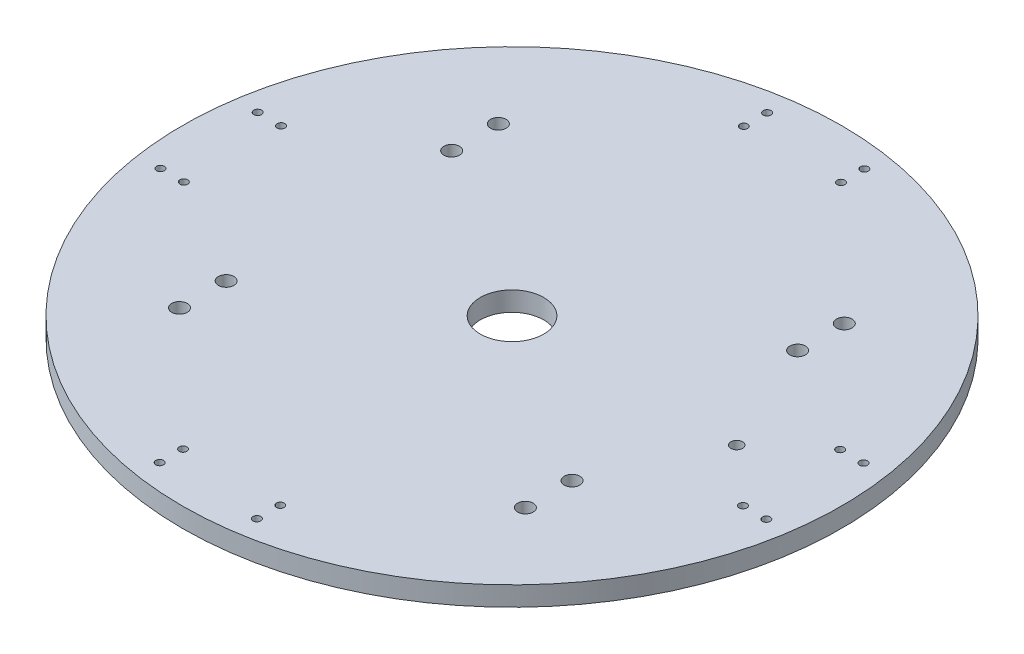
ISO-10303-21;
HEADER;
FILE_DESCRIPTION(('STEP AP214'),'2;1');
FILE_NAME('part.step','',(''),(''),'','','');
FILE_SCHEMA(('AUTOMOTIVE_DESIGN { 1 0 10303 214 1 1 1 1 }'));
ENDSEC;
DATA;
#1=APPLICATION_CONTEXT('core data for automotive mechanical design processes');
#2=APPLICATION_PROTOCOL_DEFINITION('international standard','automotive_design',2000,#1);
#3=PRODUCT_CONTEXT('',#1,'mechanical');
#4=PRODUCT('Part','Part','',(#3));
#5=PRODUCT_RELATED_PRODUCT_CATEGORY('part','',(#4));
#6=PRODUCT_DEFINITION_FORMATION('','',#4);
#7=PRODUCT_DEFINITION_CONTEXT('part definition',#1,'design');
#8=PRODUCT_DEFINITION('design','',#6,#7);
#9=PRODUCT_DEFINITION_SHAPE('','',#8);
#10=(LENGTH_UNIT() NAMED_UNIT(*) SI_UNIT(.MILLI.,.METRE.));
#11=(NAMED_UNIT(*) PLANE_ANGLE_UNIT() SI_UNIT($,.RADIAN.));
#12=(NAMED_UNIT(*) SI_UNIT($,.STERADIAN.) SOLID_ANGLE_UNIT());
#13=UNCERTAINTY_MEASURE_WITH_UNIT(LENGTH_MEASURE(1.E-05),#10,'distance_accuracy_value','');
#14=(GEOMETRIC_REPRESENTATION_CONTEXT(3) GLOBAL_UNCERTAINTY_ASSIGNED_CONTEXT((#13)) GLOBAL_UNIT_ASSIGNED_CONTEXT((#10,
#11,#12)) REPRESENTATION_CONTEXT('',''));
#15=CARTESIAN_POINT('',(0.,0.,0.));
#16=DIRECTION('',(0.,0.,1.));
#17=DIRECTION('',(1.,0.,0.));
#18=AXIS2_PLACEMENT_3D('',#15,#16,#17);
#19=CARTESIAN_POINT('',(0.,60.,0.));
#20=DIRECTION('',(0.,-1.,0.));
#21=DIRECTION('',(0.,0.,-1.));
#22=AXIS2_PLACEMENT_3D('',#19,#20,#21);
#23=PLANE('',#22);
#24=CARTESIAN_POINT('',(55.4902217167998,60.,-69.8));
#25=DIRECTION('',(0.,1.,0.));
#26=DIRECTION('',(0.,0.,1.));
#27=AXIS2_PLACEMENT_3D('',#24,#25,#26);
#28=CIRCLE('',#27,2.);
#29=CARTESIAN_POINT('',(55.4902217167998,60.,-67.8));
#30=VERTEX_POINT('',#29);
#31=EDGE_CURVE('E255',#30,#30,#28,.T.);
#32=ORIENTED_EDGE('',*,*,#31,.F.);
#33=EDGE_LOOP('',(#32));
#34=FACE_BOUND('',#33,.T.);
#35=CARTESIAN_POINT('',(55.4902217167998,60.,-57.8));
#36=DIRECTION('',(0.,1.,0.));
#37=DIRECTION('',(0.,0.,1.));
#38=AXIS2_PLACEMENT_3D('',#35,#36,#37);
#39=CIRCLE('',#38,2.);
#40=CARTESIAN_POINT('',(55.4902217167998,60.,-55.8));
#41=VERTEX_POINT('',#40);
#42=EDGE_CURVE('E247',#41,#41,#39,.T.);
#43=ORIENTED_EDGE('',*,*,#42,.F.);
#44=EDGE_LOOP('',(#43));
#45=FACE_BOUND('',#44,.T.);
#46=CARTESIAN_POINT('',(144.450852961086,60.,-57.8));
#47=DIRECTION('',(0.,1.,0.));
#48=DIRECTION('',(0.,0.,1.));
#49=AXIS2_PLACEMENT_3D('',#46,#47,#48);
#50=CIRCLE('',#49,2.);
#51=CARTESIAN_POINT('',(144.450852961086,60.,-55.8));
#52=VERTEX_POINT('',#51);
#53=EDGE_CURVE('E239',#52,#52,#50,.T.);
#54=ORIENTED_EDGE('',*,*,#53,.F.);
#55=EDGE_LOOP('',(#54));
#56=FACE_BOUND('',#55,.T.);
#57=CARTESIAN_POINT('',(144.450852961086,60.,-69.8));
#58=DIRECTION('',(0.,1.,0.));
#59=DIRECTION('',(0.,0.,1.));
#60=AXIS2_PLACEMENT_3D('',#57,#58,#59);
#61=CIRCLE('',#60,2.);
#62=CARTESIAN_POINT('',(144.450852961086,60.,-67.8));
#63=VERTEX_POINT('',#62);
#64=EDGE_CURVE('E231',#63,#63,#61,.T.);
#65=ORIENTED_EDGE('',*,*,#64,.F.);
#66=EDGE_LOOP('',(#65));
#67=FACE_BOUND('',#66,.T.);
#68=CARTESIAN_POINT('',(55.4902217167998,60.,-127.8));
#69=DIRECTION('',(0.,1.,0.));
#70=DIRECTION('',(0.,0.,1.));
#71=AXIS2_PLACEMENT_3D('',#68,#69,#70);
#72=CIRCLE('',#71,2.);
#73=CARTESIAN_POINT('',(55.4902217167998,60.,-125.8));
#74=VERTEX_POINT('',#73);
#75=EDGE_CURVE('E223',#74,#74,#72,.T.);
#76=ORIENTED_EDGE('',*,*,#75,.F.);
#77=EDGE_LOOP('',(#76));
#78=FACE_BOUND('',#77,.T.);
#79=CARTESIAN_POINT('',(55.4902217167998,60.,-139.8));
#80=DIRECTION('',(0.,1.,0.));
#81=DIRECTION('',(0.,0.,1.));
#82=AXIS2_PLACEMENT_3D('',#79,#80,#81);
#83=CIRCLE('',#82,2.);
#84=CARTESIAN_POINT('',(55.4902217167998,60.,-137.8));
#85=VERTEX_POINT('',#84);
#86=EDGE_CURVE('E215',#85,#85,#83,.T.);
#87=ORIENTED_EDGE('',*,*,#86,.F.);
#88=EDGE_LOOP('',(#87));
#89=FACE_BOUND('',#88,.T.);
#90=CARTESIAN_POINT('',(144.450852961086,60.,-139.8));
#91=DIRECTION('',(0.,1.,0.));
#92=DIRECTION('',(0.,0.,1.));
#93=AXIS2_PLACEMENT_3D('',#90,#91,#92);
#94=CIRCLE('',#93,2.);
#95=CARTESIAN_POINT('',(144.450852961086,60.,-137.8));
#96=VERTEX_POINT('',#95);
#97=EDGE_CURVE('E207',#96,#96,#94,.T.);
#98=ORIENTED_EDGE('',*,*,#97,.F.);
#99=EDGE_LOOP('',(#98));
#100=FACE_BOUND('',#99,.T.);
#101=CARTESIAN_POINT('',(144.450852961086,60.,-127.8));
#102=DIRECTION('',(0.,1.,0.));
#103=DIRECTION('',(0.,0.,1.));
#104=AXIS2_PLACEMENT_3D('',#101,#102,#103);
#105=CIRCLE('',#104,2.);
#106=CARTESIAN_POINT('',(144.450852961086,60.,-125.8));
#107=VERTEX_POINT('',#106);
#108=EDGE_CURVE('E199',#107,#107,#105,.T.);
#109=ORIENTED_EDGE('',*,*,#108,.F.);
#110=EDGE_LOOP('',(#109));
#111=FACE_BOUND('',#110,.T.);
#112=CARTESIAN_POINT('',(28.,60.,-111.4));
#113=DIRECTION('',(0.,1.,0.));
#114=DIRECTION('',(0.,0.,1.));
#115=AXIS2_PLACEMENT_3D('',#112,#113,#114);
#116=CIRCLE('',#115,0.999999999999997);
#117=CARTESIAN_POINT('',(28.,60.,-110.4));
#118=VERTEX_POINT('',#117);
#119=EDGE_CURVE('E191',#118,#118,#116,.T.);
#120=ORIENTED_EDGE('',*,*,#119,.F.);
#121=EDGE_LOOP('',(#120));
#122=FACE_BOUND('',#121,.T.);
#123=CARTESIAN_POINT('',(22.,60.,-111.4));
#124=DIRECTION('',(0.,1.,0.));
#125=DIRECTION('',(0.,0.,1.));
#126=AXIS2_PLACEMENT_3D('',#123,#124,#125);
#127=CIRCLE('',#126,0.999999999999997);
#128=CARTESIAN_POINT('',(22.,60.,-110.4));
#129=VERTEX_POINT('',#128);
#130=EDGE_CURVE('E183',#129,#129,#127,.T.);
#131=ORIENTED_EDGE('',*,*,#130,.F.);
#132=EDGE_LOOP('',(#131));
#133=FACE_BOUND('',#132,.T.);
#134=CARTESIAN_POINT('',(28.,60.,-86.4));
#135=DIRECTION('',(0.,1.,0.));
#136=DIRECTION('',(0.,0.,1.));
#137=AXIS2_PLACEMENT_3D('',#134,#135,#136);
#138=CIRCLE('',#137,0.999999999999997);
#139=CARTESIAN_POINT('',(28.,60.,-85.4));
#140=VERTEX_POINT('',#139);
#141=EDGE_CURVE('E175',#140,#140,#138,.T.);
#142=ORIENTED_EDGE('',*,*,#141,.F.);
#143=EDGE_LOOP('',(#142));
#144=FACE_BOUND('',#143,.T.);
#145=CARTESIAN_POINT('',(22.,60.,-86.4));
#146=DIRECTION('',(0.,1.,0.));
#147=DIRECTION('',(0.,0.,1.));
#148=AXIS2_PLACEMENT_3D('',#145,#146,#147);
#149=CIRCLE('',#148,0.999999999999997);
#150=CARTESIAN_POINT('',(22.,60.,-85.4));
#151=VERTEX_POINT('',#150);
#152=EDGE_CURVE('E167',#151,#151,#149,.T.);
#153=ORIENTED_EDGE('',*,*,#152,.F.);
#154=EDGE_LOOP('',(#153));
#155=FACE_BOUND('',#154,.T.);
#156=CARTESIAN_POINT('',(87.3999999999993,60.,-26.8000000000001));
#157=DIRECTION('',(0.,1.,0.));
#158=DIRECTION('',(0.,0.,1.));
#159=AXIS2_PLACEMENT_3D('',#156,#157,#158);
#160=CIRCLE('',#159,1.);
#161=CARTESIAN_POINT('',(87.3999999999993,60.,-25.8000000000001));
#162=VERTEX_POINT('',#161);
#163=EDGE_CURVE('E159',#162,#162,#160,.T.);
#164=ORIENTED_EDGE('',*,*,#163,.F.);
#165=EDGE_LOOP('',(#164));
#166=FACE_BOUND('',#165,.T.);
#167=CARTESIAN_POINT('',(87.3999999999992,60.,-20.8000000000001));
#168=DIRECTION('',(0.,1.,0.));
#169=DIRECTION('',(0.,0.,1.));
#170=AXIS2_PLACEMENT_3D('',#167,#168,#169);
#171=CIRCLE('',#170,1.);
#172=CARTESIAN_POINT('',(87.3999999999992,60.,-19.8000000000001));
#173=VERTEX_POINT('',#172);
#174=EDGE_CURVE('E151',#173,#173,#171,.T.);
#175=ORIENTED_EDGE('',*,*,#174,.F.);
#176=EDGE_LOOP('',(#175));
#177=FACE_BOUND('',#176,.T.);
#178=CARTESIAN_POINT('',(112.399999999999,60.,-20.7999999999999));
#179=DIRECTION('',(0.,1.,0.));
#180=DIRECTION('',(0.,0.,1.));
#181=AXIS2_PLACEMENT_3D('',#178,#179,#180);
#182=CIRCLE('',#181,1.);
#183=CARTESIAN_POINT('',(112.399999999999,60.,-19.7999999999999));
#184=VERTEX_POINT('',#183);
#185=EDGE_CURVE('E143',#184,#184,#182,.T.);
#186=ORIENTED_EDGE('',*,*,#185,.F.);
#187=EDGE_LOOP('',(#186));
#188=FACE_BOUND('',#187,.T.);
#189=CARTESIAN_POINT('',(112.399999999999,60.,-26.7999999999999));
#190=DIRECTION('',(0.,1.,0.));
#191=DIRECTION('',(0.,0.,1.));
#192=AXIS2_PLACEMENT_3D('',#189,#190,#191);
#193=CIRCLE('',#192,1.);
#194=CARTESIAN_POINT('',(112.399999999999,60.,-25.7999999999999));
#195=VERTEX_POINT('',#194);
#196=EDGE_CURVE('E135',#195,#195,#193,.T.);
#197=ORIENTED_EDGE('',*,*,#196,.F.);
#198=EDGE_LOOP('',(#197));
#199=FACE_BOUND('',#198,.T.);
#200=CARTESIAN_POINT('',(172.,60.,-86.1999999999995));
#201=DIRECTION('',(0.,1.,0.));
#202=DIRECTION('',(0.,0.,1.));
#203=AXIS2_PLACEMENT_3D('',#200,#201,#202);
#204=CIRCLE('',#203,1.);
#205=CARTESIAN_POINT('',(172.,60.,-85.1999999999995));
#206=VERTEX_POINT('',#205);
#207=EDGE_CURVE('E127',#206,#206,#204,.T.);
#208=ORIENTED_EDGE('',*,*,#207,.F.);
#209=EDGE_LOOP('',(#208));
#210=FACE_BOUND('',#209,.T.);
#211=CARTESIAN_POINT('',(178.,60.,-86.1999999999995));
#212=DIRECTION('',(0.,1.,0.));
#213=DIRECTION('',(0.,0.,1.));
#214=AXIS2_PLACEMENT_3D('',#211,#212,#213);
#215=CIRCLE('',#214,1.);
#216=CARTESIAN_POINT('',(178.,60.,-85.1999999999995));
#217=VERTEX_POINT('',#216);
#218=EDGE_CURVE('E119',#217,#217,#215,.T.);
#219=ORIENTED_EDGE('',*,*,#218,.F.);
#220=EDGE_LOOP('',(#219));
#221=FACE_BOUND('',#220,.T.);
#222=CARTESIAN_POINT('',(172.,60.,-111.199999999999));
#223=DIRECTION('',(0.,1.,0.));
#224=DIRECTION('',(0.,0.,1.));
#225=AXIS2_PLACEMENT_3D('',#222,#223,#224);
#226=CIRCLE('',#225,1.);
#227=CARTESIAN_POINT('',(172.,60.,-110.199999999999));
#228=VERTEX_POINT('',#227);
#229=EDGE_CURVE('E111',#228,#228,#226,.T.);
#230=ORIENTED_EDGE('',*,*,#229,.F.);
#231=EDGE_LOOP('',(#230));
#232=FACE_BOUND('',#231,.T.);
#233=CARTESIAN_POINT('',(178.,60.,-111.199999999999));
#234=DIRECTION('',(0.,1.,0.));
#235=DIRECTION('',(0.,0.,1.));
#236=AXIS2_PLACEMENT_3D('',#233,#234,#235);
#237=CIRCLE('',#236,1.);
#238=CARTESIAN_POINT('',(178.,60.,-110.199999999999));
#239=VERTEX_POINT('',#238);
#240=EDGE_CURVE('E103',#239,#239,#237,.T.);
#241=ORIENTED_EDGE('',*,*,#240,.F.);
#242=EDGE_LOOP('',(#241));
#243=FACE_BOUND('',#242,.T.);
#244=CARTESIAN_POINT('',(87.6000000000003,60.,-170.8));
#245=DIRECTION('',(0.,1.,0.));
#246=DIRECTION('',(0.,0.,1.));
#247=AXIS2_PLACEMENT_3D('',#244,#245,#246);
#248=CIRCLE('',#247,1.);
#249=CARTESIAN_POINT('',(87.6000000000003,60.,-169.8));
#250=VERTEX_POINT('',#249);
#251=EDGE_CURVE('E95',#250,#250,#248,.T.);
#252=ORIENTED_EDGE('',*,*,#251,.F.);
#253=EDGE_LOOP('',(#252));
#254=FACE_BOUND('',#253,.T.);
#255=CARTESIAN_POINT('',(112.6,60.,-170.8));
#256=DIRECTION('',(0.,1.,0.));
#257=DIRECTION('',(0.,0.,1.));
#258=AXIS2_PLACEMENT_3D('',#255,#256,#257);
#259=CIRCLE('',#258,1.);
#260=CARTESIAN_POINT('',(112.6,60.,-169.8));
#261=VERTEX_POINT('',#260);
#262=EDGE_CURVE('E87',#261,#261,#259,.T.);
#263=ORIENTED_EDGE('',*,*,#262,.F.);
#264=EDGE_LOOP('',(#263));
#265=FACE_BOUND('',#264,.T.);
#266=CARTESIAN_POINT('',(87.6000000000003,60.,-176.8));
#267=DIRECTION('',(0.,1.,0.));
#268=DIRECTION('',(0.,0.,1.));
#269=AXIS2_PLACEMENT_3D('',#266,#267,#268);
#270=CIRCLE('',#269,1.);
#271=CARTESIAN_POINT('',(87.6000000000003,60.,-175.8));
#272=VERTEX_POINT('',#271);
#273=EDGE_CURVE('E79',#272,#272,#270,.T.);
#274=ORIENTED_EDGE('',*,*,#273,.F.);
#275=EDGE_LOOP('',(#274));
#276=FACE_BOUND('',#275,.T.);
#277=CARTESIAN_POINT('',(112.6,60.,-176.8));
#278=DIRECTION('',(0.,1.,0.));
#279=DIRECTION('',(0.,0.,1.));
#280=AXIS2_PLACEMENT_3D('',#277,#278,#279);
#281=CIRCLE('',#280,1.);
#282=CARTESIAN_POINT('',(112.6,60.,-175.8));
#283=VERTEX_POINT('',#282);
#284=EDGE_CURVE('E71',#283,#283,#281,.T.);
#285=ORIENTED_EDGE('',*,*,#284,.F.);
#286=EDGE_LOOP('',(#285));
#287=FACE_BOUND('',#286,.T.);
#288=CARTESIAN_POINT('',(100.,60.,-98.8));
#289=DIRECTION('',(0.,-1.,0.));
#290=DIRECTION('',(0.,0.,-1.));
#291=AXIS2_PLACEMENT_3D('',#288,#289,#290);
#292=CIRCLE('',#291,8.16);
#293=CARTESIAN_POINT('',(100.,60.,-106.96));
#294=VERTEX_POINT('',#293);
#295=EDGE_CURVE('E59',#294,#294,#292,.T.);
#296=ORIENTED_EDGE('',*,*,#295,.T.);
#297=EDGE_LOOP('',(#296));
#298=FACE_BOUND('',#297,.T.);
#299=CARTESIAN_POINT('',(157.690598923241,60.,-98.9));
#300=DIRECTION('',(0.,1.,0.));
#301=DIRECTION('',(0.,0.,1.));
#302=AXIS2_PLACEMENT_3D('',#299,#300,#301);
#303=CIRCLE('',#302,1.5);
#304=CARTESIAN_POINT('',(157.690598923241,60.,-97.4));
#305=VERTEX_POINT('',#304);
#306=EDGE_CURVE('E55',#305,#305,#303,.T.);
#307=ORIENTED_EDGE('',*,*,#306,.F.);
#308=EDGE_LOOP('',(#307));
#309=FACE_BOUND('',#308,.T.);
#310=CARTESIAN_POINT('',(100.,60.,-98.8));
#311=DIRECTION('',(0.,1.,0.));
#312=DIRECTION('',(0.,0.,1.));
#313=AXIS2_PLACEMENT_3D('',#310,#311,#312);
#314=CIRCLE('',#313,84.75);
#315=CARTESIAN_POINT('',(100.,60.,-14.05));
#316=VERTEX_POINT('',#315);
#317=EDGE_CURVE('E48',#316,#316,#314,.T.);
#318=ORIENTED_EDGE('',*,*,#317,.T.);
#319=EDGE_LOOP('',(#318));
#320=FACE_BOUND('',#319,.T.);
#321=ADVANCED_FACE('F39',(#34,#45,#56,#67,#78,#89,#100,#111,#122,#133,#144,#155,#166,#177,#188,
#199,#210,#221,#232,#243,#254,#265,#276,#287,#298,#309,#320),#23,.F.);
#322=CARTESIAN_POINT('',(100.,55.,-98.8));
#323=DIRECTION('',(0.,1.,0.));
#324=DIRECTION('',(0.,0.,1.));
#325=AXIS2_PLACEMENT_3D('',#322,#323,#324);
#326=CYLINDRICAL_SURFACE('',#325,84.75);
#327=CARTESIAN_POINT('',(100.,55.,-98.8));
#328=DIRECTION('',(0.,1.,0.));
#329=DIRECTION('',(0.,0.,1.));
#330=AXIS2_PLACEMENT_3D('',#327,#328,#329);
#331=CIRCLE('',#330,84.75);
#332=CARTESIAN_POINT('',(100.,55.,-14.05));
#333=VERTEX_POINT('',#332);
#334=EDGE_CURVE('E10',#333,#333,#331,.T.);
#335=ORIENTED_EDGE('',*,*,#334,.T.);
#336=EDGE_LOOP('',(#335));
#337=FACE_BOUND('',#336,.T.);
#338=ORIENTED_EDGE('',*,*,#317,.F.);
#339=EDGE_LOOP('',(#338));
#340=FACE_BOUND('',#339,.T.);
#341=ADVANCED_FACE('F264',(#337,#340),#326,.T.);
#342=CARTESIAN_POINT('',(195.,55.,0.));
#343=DIRECTION('',(0.,1.,0.));
#344=DIRECTION('',(0.,0.,1.));
#345=AXIS2_PLACEMENT_3D('',#342,#343,#344);
#346=PLANE('',#345);
#347=CARTESIAN_POINT('',(55.4902217167998,55.,-69.8));
#348=DIRECTION('',(0.,1.,0.));
#349=DIRECTION('',(0.,0.,1.));
#350=AXIS2_PLACEMENT_3D('',#347,#348,#349);
#351=CIRCLE('',#350,1.99999999999999);
#352=CARTESIAN_POINT('',(55.4902217167998,55.,-67.8));
#353=VERTEX_POINT('',#352);
#354=EDGE_CURVE('E251',#353,#353,#351,.T.);
#355=ORIENTED_EDGE('',*,*,#354,.T.);
#356=EDGE_LOOP('',(#355));
#357=FACE_BOUND('',#356,.T.);
#358=CARTESIAN_POINT('',(55.4902217167998,55.,-57.8));
#359=DIRECTION('',(0.,1.,0.));
#360=DIRECTION('',(0.,0.,1.));
#361=AXIS2_PLACEMENT_3D('',#358,#359,#360);
#362=CIRCLE('',#361,1.99999999999999);
#363=CARTESIAN_POINT('',(55.4902217167998,55.,-55.8));
#364=VERTEX_POINT('',#363);
#365=EDGE_CURVE('E243',#364,#364,#362,.T.);
#366=ORIENTED_EDGE('',*,*,#365,.T.);
#367=EDGE_LOOP('',(#366));
#368=FACE_BOUND('',#367,.T.);
#369=CARTESIAN_POINT('',(144.450852961086,55.,-57.8));
#370=DIRECTION('',(0.,1.,0.));
#371=DIRECTION('',(0.,0.,1.));
#372=AXIS2_PLACEMENT_3D('',#369,#370,#371);
#373=CIRCLE('',#372,2.);
#374=CARTESIAN_POINT('',(144.450852961086,55.,-55.8));
#375=VERTEX_POINT('',#374);
#376=EDGE_CURVE('E235',#375,#375,#373,.T.);
#377=ORIENTED_EDGE('',*,*,#376,.T.);
#378=EDGE_LOOP('',(#377));
#379=FACE_BOUND('',#378,.T.);
#380=CARTESIAN_POINT('',(144.450852961086,55.,-69.8));
#381=DIRECTION('',(0.,1.,0.));
#382=DIRECTION('',(0.,0.,1.));
#383=AXIS2_PLACEMENT_3D('',#380,#381,#382);
#384=CIRCLE('',#383,2.);
#385=CARTESIAN_POINT('',(144.450852961086,55.,-67.8));
#386=VERTEX_POINT('',#385);
#387=EDGE_CURVE('E227',#386,#386,#384,.T.);
#388=ORIENTED_EDGE('',*,*,#387,.T.);
#389=EDGE_LOOP('',(#388));
#390=FACE_BOUND('',#389,.T.);
#391=CARTESIAN_POINT('',(55.4902217167998,55.,-127.8));
#392=DIRECTION('',(0.,1.,0.));
#393=DIRECTION('',(0.,0.,1.));
#394=AXIS2_PLACEMENT_3D('',#391,#392,#393);
#395=CIRCLE('',#394,1.99999999999999);
#396=CARTESIAN_POINT('',(55.4902217167998,55.,-125.8));
#397=VERTEX_POINT('',#396);
#398=EDGE_CURVE('E219',#397,#397,#395,.T.);
#399=ORIENTED_EDGE('',*,*,#398,.T.);
#400=EDGE_LOOP('',(#399));
#401=FACE_BOUND('',#400,.T.);
#402=CARTESIAN_POINT('',(55.4902217167998,55.,-139.8));
#403=DIRECTION('',(0.,1.,0.));
#404=DIRECTION('',(0.,0.,1.));
#405=AXIS2_PLACEMENT_3D('',#402,#403,#404);
#406=CIRCLE('',#405,1.99999999999999);
#407=CARTESIAN_POINT('',(55.4902217167998,55.,-137.8));
#408=VERTEX_POINT('',#407);
#409=EDGE_CURVE('E211',#408,#408,#406,.T.);
#410=ORIENTED_EDGE('',*,*,#409,.T.);
#411=EDGE_LOOP('',(#410));
#412=FACE_BOUND('',#411,.T.);
#413=CARTESIAN_POINT('',(144.450852961086,55.,-139.8));
#414=DIRECTION('',(0.,1.,0.));
#415=DIRECTION('',(0.,0.,1.));
#416=AXIS2_PLACEMENT_3D('',#413,#414,#415);
#417=CIRCLE('',#416,2.);
#418=CARTESIAN_POINT('',(144.450852961086,55.,-137.8));
#419=VERTEX_POINT('',#418);
#420=EDGE_CURVE('E203',#419,#419,#417,.T.);
#421=ORIENTED_EDGE('',*,*,#420,.T.);
#422=EDGE_LOOP('',(#421));
#423=FACE_BOUND('',#422,.T.);
#424=CARTESIAN_POINT('',(144.450852961086,55.,-127.8));
#425=DIRECTION('',(0.,1.,0.));
#426=DIRECTION('',(0.,0.,1.));
#427=AXIS2_PLACEMENT_3D('',#424,#425,#426);
#428=CIRCLE('',#427,2.);
#429=CARTESIAN_POINT('',(144.450852961086,55.,-125.8));
#430=VERTEX_POINT('',#429);
#431=EDGE_CURVE('E195',#430,#430,#428,.T.);
#432=ORIENTED_EDGE('',*,*,#431,.T.);
#433=EDGE_LOOP('',(#432));
#434=FACE_BOUND('',#433,.T.);
#435=CARTESIAN_POINT('',(28.,55.,-111.4));
#436=DIRECTION('',(0.,1.,0.));
#437=DIRECTION('',(0.,0.,1.));
#438=AXIS2_PLACEMENT_3D('',#435,#436,#437);
#439=CIRCLE('',#438,0.999999999999997);
#440=CARTESIAN_POINT('',(28.,55.,-110.4));
#441=VERTEX_POINT('',#440);
#442=EDGE_CURVE('E187',#441,#441,#439,.T.);
#443=ORIENTED_EDGE('',*,*,#442,.T.);
#444=EDGE_LOOP('',(#443));
#445=FACE_BOUND('',#444,.T.);
#446=CARTESIAN_POINT('',(22.,55.,-111.4));
#447=DIRECTION('',(0.,1.,0.));
#448=DIRECTION('',(0.,0.,1.));
#449=AXIS2_PLACEMENT_3D('',#446,#447,#448);
#450=CIRCLE('',#449,0.999999999999997);
#451=CARTESIAN_POINT('',(22.,55.,-110.4));
#452=VERTEX_POINT('',#451);
#453=EDGE_CURVE('E179',#452,#452,#450,.T.);
#454=ORIENTED_EDGE('',*,*,#453,.T.);
#455=EDGE_LOOP('',(#454));
#456=FACE_BOUND('',#455,.T.);
#457=CARTESIAN_POINT('',(28.,55.,-86.4));
#458=DIRECTION('',(0.,1.,0.));
#459=DIRECTION('',(0.,0.,1.));
#460=AXIS2_PLACEMENT_3D('',#457,#458,#459);
#461=CIRCLE('',#460,0.999999999999997);
#462=CARTESIAN_POINT('',(28.,55.,-85.4));
#463=VERTEX_POINT('',#462);
#464=EDGE_CURVE('E171',#463,#463,#461,.T.);
#465=ORIENTED_EDGE('',*,*,#464,.T.);
#466=EDGE_LOOP('',(#465));
#467=FACE_BOUND('',#466,.T.);
#468=CARTESIAN_POINT('',(22.,55.,-86.4));
#469=DIRECTION('',(0.,1.,0.));
#470=DIRECTION('',(0.,0.,1.));
#471=AXIS2_PLACEMENT_3D('',#468,#469,#470);
#472=CIRCLE('',#471,0.999999999999997);
#473=CARTESIAN_POINT('',(22.,55.,-85.4));
#474=VERTEX_POINT('',#473);
#475=EDGE_CURVE('E163',#474,#474,#472,.T.);
#476=ORIENTED_EDGE('',*,*,#475,.T.);
#477=EDGE_LOOP('',(#476));
#478=FACE_BOUND('',#477,.T.);
#479=CARTESIAN_POINT('',(87.3999999999993,55.,-26.8000000000001));
#480=DIRECTION('',(0.,1.,0.));
#481=DIRECTION('',(0.,0.,1.));
#482=AXIS2_PLACEMENT_3D('',#479,#480,#481);
#483=CIRCLE('',#482,1.);
#484=CARTESIAN_POINT('',(87.3999999999993,55.,-25.8000000000001));
#485=VERTEX_POINT('',#484);
#486=EDGE_CURVE('E155',#485,#485,#483,.T.);
#487=ORIENTED_EDGE('',*,*,#486,.T.);
#488=EDGE_LOOP('',(#487));
#489=FACE_BOUND('',#488,.T.);
#490=CARTESIAN_POINT('',(87.3999999999992,55.,-20.8000000000001));
#491=DIRECTION('',(0.,1.,0.));
#492=DIRECTION('',(0.,0.,1.));
#493=AXIS2_PLACEMENT_3D('',#490,#491,#492);
#494=CIRCLE('',#493,1.);
#495=CARTESIAN_POINT('',(87.3999999999992,55.,-19.8000000000001));
#496=VERTEX_POINT('',#495);
#497=EDGE_CURVE('E147',#496,#496,#494,.T.);
#498=ORIENTED_EDGE('',*,*,#497,.T.);
#499=EDGE_LOOP('',(#498));
#500=FACE_BOUND('',#499,.T.);
#501=CARTESIAN_POINT('',(112.399999999999,55.,-20.7999999999999));
#502=DIRECTION('',(0.,1.,0.));
#503=DIRECTION('',(0.,0.,1.));
#504=AXIS2_PLACEMENT_3D('',#501,#502,#503);
#505=CIRCLE('',#504,1.);
#506=CARTESIAN_POINT('',(112.399999999999,55.,-19.7999999999999));
#507=VERTEX_POINT('',#506);
#508=EDGE_CURVE('E139',#507,#507,#505,.T.);
#509=ORIENTED_EDGE('',*,*,#508,.T.);
#510=EDGE_LOOP('',(#509));
#511=FACE_BOUND('',#510,.T.);
#512=CARTESIAN_POINT('',(112.399999999999,55.,-26.7999999999999));
#513=DIRECTION('',(0.,1.,0.));
#514=DIRECTION('',(0.,0.,1.));
#515=AXIS2_PLACEMENT_3D('',#512,#513,#514);
#516=CIRCLE('',#515,1.);
#517=CARTESIAN_POINT('',(112.399999999999,55.,-25.7999999999999));
#518=VERTEX_POINT('',#517);
#519=EDGE_CURVE('E131',#518,#518,#516,.T.);
#520=ORIENTED_EDGE('',*,*,#519,.T.);
#521=EDGE_LOOP('',(#520));
#522=FACE_BOUND('',#521,.T.);
#523=CARTESIAN_POINT('',(172.,55.,-86.1999999999995));
#524=DIRECTION('',(0.,1.,0.));
#525=DIRECTION('',(0.,0.,1.));
#526=AXIS2_PLACEMENT_3D('',#523,#524,#525);
#527=CIRCLE('',#526,1.);
#528=CARTESIAN_POINT('',(172.,55.,-85.1999999999995));
#529=VERTEX_POINT('',#528);
#530=EDGE_CURVE('E123',#529,#529,#527,.T.);
#531=ORIENTED_EDGE('',*,*,#530,.T.);
#532=EDGE_LOOP('',(#531));
#533=FACE_BOUND('',#532,.T.);
#534=CARTESIAN_POINT('',(178.,55.,-86.1999999999995));
#535=DIRECTION('',(0.,1.,0.));
#536=DIRECTION('',(0.,0.,1.));
#537=AXIS2_PLACEMENT_3D('',#534,#535,#536);
#538=CIRCLE('',#537,1.);
#539=CARTESIAN_POINT('',(178.,55.,-85.1999999999995));
#540=VERTEX_POINT('',#539);
#541=EDGE_CURVE('E115',#540,#540,#538,.T.);
#542=ORIENTED_EDGE('',*,*,#541,.T.);
#543=EDGE_LOOP('',(#542));
#544=FACE_BOUND('',#543,.T.);
#545=CARTESIAN_POINT('',(172.,55.,-111.199999999999));
#546=DIRECTION('',(0.,1.,0.));
#547=DIRECTION('',(0.,0.,1.));
#548=AXIS2_PLACEMENT_3D('',#545,#546,#547);
#549=CIRCLE('',#548,1.);
#550=CARTESIAN_POINT('',(172.,55.,-110.199999999999));
#551=VERTEX_POINT('',#550);
#552=EDGE_CURVE('E107',#551,#551,#549,.T.);
#553=ORIENTED_EDGE('',*,*,#552,.T.);
#554=EDGE_LOOP('',(#553));
#555=FACE_BOUND('',#554,.T.);
#556=CARTESIAN_POINT('',(178.,55.,-111.199999999999));
#557=DIRECTION('',(0.,1.,0.));
#558=DIRECTION('',(0.,0.,1.));
#559=AXIS2_PLACEMENT_3D('',#556,#557,#558);
#560=CIRCLE('',#559,1.);
#561=CARTESIAN_POINT('',(178.,55.,-110.199999999999));
#562=VERTEX_POINT('',#561);
#563=EDGE_CURVE('E99',#562,#562,#560,.T.);
#564=ORIENTED_EDGE('',*,*,#563,.T.);
#565=EDGE_LOOP('',(#564));
#566=FACE_BOUND('',#565,.T.);
#567=CARTESIAN_POINT('',(87.6000000000003,55.,-170.8));
#568=DIRECTION('',(0.,1.,0.));
#569=DIRECTION('',(0.,0.,1.));
#570=AXIS2_PLACEMENT_3D('',#567,#568,#569);
#571=CIRCLE('',#570,1.);
#572=CARTESIAN_POINT('',(87.6000000000003,55.,-169.8));
#573=VERTEX_POINT('',#572);
#574=EDGE_CURVE('E91',#573,#573,#571,.T.);
#575=ORIENTED_EDGE('',*,*,#574,.T.);
#576=EDGE_LOOP('',(#575));
#577=FACE_BOUND('',#576,.T.);
#578=CARTESIAN_POINT('',(112.6,55.,-170.8));
#579=DIRECTION('',(0.,1.,0.));
#580=DIRECTION('',(0.,0.,1.));
#581=AXIS2_PLACEMENT_3D('',#578,#579,#580);
#582=CIRCLE('',#581,1.);
#583=CARTESIAN_POINT('',(112.6,55.,-169.8));
#584=VERTEX_POINT('',#583);
#585=EDGE_CURVE('E83',#584,#584,#582,.T.);
#586=ORIENTED_EDGE('',*,*,#585,.T.);
#587=EDGE_LOOP('',(#586));
#588=FACE_BOUND('',#587,.T.);
#589=CARTESIAN_POINT('',(87.6000000000003,55.,-176.8));
#590=DIRECTION('',(0.,1.,0.));
#591=DIRECTION('',(0.,0.,1.));
#592=AXIS2_PLACEMENT_3D('',#589,#590,#591);
#593=CIRCLE('',#592,1.);
#594=CARTESIAN_POINT('',(87.6000000000003,55.,-175.8));
#595=VERTEX_POINT('',#594);
#596=EDGE_CURVE('E75',#595,#595,#593,.T.);
#597=ORIENTED_EDGE('',*,*,#596,.T.);
#598=EDGE_LOOP('',(#597));
#599=FACE_BOUND('',#598,.T.);
#600=CARTESIAN_POINT('',(112.6,55.,-176.8));
#601=DIRECTION('',(0.,1.,0.));
#602=DIRECTION('',(0.,0.,1.));
#603=AXIS2_PLACEMENT_3D('',#600,#601,#602);
#604=CIRCLE('',#603,1.);
#605=CARTESIAN_POINT('',(112.6,55.,-175.8));
#606=VERTEX_POINT('',#605);
#607=EDGE_CURVE('E67',#606,#606,#604,.T.);
#608=ORIENTED_EDGE('',*,*,#607,.T.);
#609=EDGE_LOOP('',(#608));
#610=FACE_BOUND('',#609,.T.);
#611=CARTESIAN_POINT('',(100.,55.,-98.8));
#612=DIRECTION('',(0.,-1.,0.));
#613=DIRECTION('',(0.,0.,-1.));
#614=AXIS2_PLACEMENT_3D('',#611,#612,#613);
#615=CIRCLE('',#614,8.16);
#616=CARTESIAN_POINT('',(100.,55.,-106.96));
#617=VERTEX_POINT('',#616);
#618=EDGE_CURVE('E63',#617,#617,#615,.T.);
#619=ORIENTED_EDGE('',*,*,#618,.F.);
#620=EDGE_LOOP('',(#619));
#621=FACE_BOUND('',#620,.T.);
#622=CARTESIAN_POINT('',(157.690598923241,55.,-98.9));
#623=DIRECTION('',(0.,1.,0.));
#624=DIRECTION('',(0.,0.,1.));
#625=AXIS2_PLACEMENT_3D('',#622,#623,#624);
#626=CIRCLE('',#625,1.5);
#627=CARTESIAN_POINT('',(157.690598923241,55.,-97.4));
#628=VERTEX_POINT('',#627);
#629=EDGE_CURVE('E43',#628,#628,#626,.T.);
#630=ORIENTED_EDGE('',*,*,#629,.T.);
#631=EDGE_LOOP('',(#630));
#632=FACE_BOUND('',#631,.T.);
#633=ORIENTED_EDGE('',*,*,#334,.F.);
#634=EDGE_LOOP('',(#633));
#635=FACE_BOUND('',#634,.T.);
#636=ADVANCED_FACE('F41',(#357,#368,#379,#390,#401,#412,#423,#434,#445,#456,#467,#478,#489,#500,
#511,#522,#533,#544,#555,#566,#577,#588,#599,#610,#621,#632,#635),#346,.F.);
#637=CARTESIAN_POINT('',(157.690598923241,-240.,-98.9));
#638=DIRECTION('',(0.,1.,0.));
#639=DIRECTION('',(0.,0.,1.));
#640=AXIS2_PLACEMENT_3D('',#637,#638,#639);
#641=CYLINDRICAL_SURFACE('',#640,1.5);
#642=ORIENTED_EDGE('',*,*,#306,.T.);
#643=EDGE_LOOP('',(#642));
#644=FACE_BOUND('',#643,.T.);
#645=ORIENTED_EDGE('',*,*,#629,.F.);
#646=EDGE_LOOP('',(#645));
#647=FACE_BOUND('',#646,.T.);
#648=ADVANCED_FACE('F322',(#644,#647),#641,.F.);
#649=CARTESIAN_POINT('',(100.,65.,-98.8));
#650=DIRECTION('',(0.,-1.,0.));
#651=DIRECTION('',(0.,0.,-1.));
#652=AXIS2_PLACEMENT_3D('',#649,#650,#651);
#653=CYLINDRICAL_SURFACE('',#652,8.16);
#654=ORIENTED_EDGE('',*,*,#618,.T.);
#655=EDGE_LOOP('',(#654));
#656=FACE_BOUND('',#655,.T.);
#657=ORIENTED_EDGE('',*,*,#295,.F.);
#658=EDGE_LOOP('',(#657));
#659=FACE_BOUND('',#658,.T.);
#660=ADVANCED_FACE('F327',(#656,#659),#653,.F.);
#661=CARTESIAN_POINT('',(112.6,60.,-176.8));
#662=DIRECTION('',(0.,1.,0.));
#663=DIRECTION('',(0.,0.,1.));
#664=AXIS2_PLACEMENT_3D('',#661,#662,#663);
#665=CYLINDRICAL_SURFACE('',#664,1.);
#666=ORIENTED_EDGE('',*,*,#607,.F.);
#667=EDGE_LOOP('',(#666));
#668=FACE_BOUND('',#667,.T.);
#669=ORIENTED_EDGE('',*,*,#284,.T.);
#670=EDGE_LOOP('',(#669));
#671=FACE_BOUND('',#670,.T.);
#672=ADVANCED_FACE('F331',(#668,#671),#665,.F.);
#673=CARTESIAN_POINT('',(87.6000000000003,60.,-176.8));
#674=DIRECTION('',(0.,1.,0.));
#675=DIRECTION('',(0.,0.,1.));
#676=AXIS2_PLACEMENT_3D('',#673,#674,#675);
#677=CYLINDRICAL_SURFACE('',#676,1.);
#678=ORIENTED_EDGE('',*,*,#596,.F.);
#679=EDGE_LOOP('',(#678));
#680=FACE_BOUND('',#679,.T.);
#681=ORIENTED_EDGE('',*,*,#273,.T.);
#682=EDGE_LOOP('',(#681));
#683=FACE_BOUND('',#682,.T.);
#684=ADVANCED_FACE('F335',(#680,#683),#677,.F.);
#685=CARTESIAN_POINT('',(112.6,60.,-170.8));
#686=DIRECTION('',(0.,1.,0.));
#687=DIRECTION('',(0.,0.,1.));
#688=AXIS2_PLACEMENT_3D('',#685,#686,#687);
#689=CYLINDRICAL_SURFACE('',#688,1.);
#690=ORIENTED_EDGE('',*,*,#585,.F.);
#691=EDGE_LOOP('',(#690));
#692=FACE_BOUND('',#691,.T.);
#693=ORIENTED_EDGE('',*,*,#262,.T.);
#694=EDGE_LOOP('',(#693));
#695=FACE_BOUND('',#694,.T.);
#696=ADVANCED_FACE('F339',(#692,#695),#689,.F.);
#697=CARTESIAN_POINT('',(87.6000000000003,60.,-170.8));
#698=DIRECTION('',(0.,1.,0.));
#699=DIRECTION('',(0.,0.,1.));
#700=AXIS2_PLACEMENT_3D('',#697,#698,#699);
#701=CYLINDRICAL_SURFACE('',#700,1.);
#702=ORIENTED_EDGE('',*,*,#574,.F.);
#703=EDGE_LOOP('',(#702));
#704=FACE_BOUND('',#703,.T.);
#705=ORIENTED_EDGE('',*,*,#251,.T.);
#706=EDGE_LOOP('',(#705));
#707=FACE_BOUND('',#706,.T.);
#708=ADVANCED_FACE('F343',(#704,#707),#701,.F.);
#709=CARTESIAN_POINT('',(178.,60.,-111.199999999999));
#710=DIRECTION('',(0.,1.,0.));
#711=DIRECTION('',(0.,0.,1.));
#712=AXIS2_PLACEMENT_3D('',#709,#710,#711);
#713=CYLINDRICAL_SURFACE('',#712,1.);
#714=ORIENTED_EDGE('',*,*,#563,.F.);
#715=EDGE_LOOP('',(#714));
#716=FACE_BOUND('',#715,.T.);
#717=ORIENTED_EDGE('',*,*,#240,.T.);
#718=EDGE_LOOP('',(#717));
#719=FACE_BOUND('',#718,.T.);
#720=ADVANCED_FACE('F347',(#716,#719),#713,.F.);
#721=CARTESIAN_POINT('',(172.,60.,-111.199999999999));
#722=DIRECTION('',(0.,1.,0.));
#723=DIRECTION('',(0.,0.,1.));
#724=AXIS2_PLACEMENT_3D('',#721,#722,#723);
#725=CYLINDRICAL_SURFACE('',#724,1.);
#726=ORIENTED_EDGE('',*,*,#552,.F.);
#727=EDGE_LOOP('',(#726));
#728=FACE_BOUND('',#727,.T.);
#729=ORIENTED_EDGE('',*,*,#229,.T.);
#730=EDGE_LOOP('',(#729));
#731=FACE_BOUND('',#730,.T.);
#732=ADVANCED_FACE('F351',(#728,#731),#725,.F.);
#733=CARTESIAN_POINT('',(178.,60.,-86.1999999999995));
#734=DIRECTION('',(0.,1.,0.));
#735=DIRECTION('',(0.,0.,1.));
#736=AXIS2_PLACEMENT_3D('',#733,#734,#735);
#737=CYLINDRICAL_SURFACE('',#736,1.);
#738=ORIENTED_EDGE('',*,*,#541,.F.);
#739=EDGE_LOOP('',(#738));
#740=FACE_BOUND('',#739,.T.);
#741=ORIENTED_EDGE('',*,*,#218,.T.);
#742=EDGE_LOOP('',(#741));
#743=FACE_BOUND('',#742,.T.);
#744=ADVANCED_FACE('F355',(#740,#743),#737,.F.);
#745=CARTESIAN_POINT('',(172.,60.,-86.1999999999995));
#746=DIRECTION('',(0.,1.,0.));
#747=DIRECTION('',(0.,0.,1.));
#748=AXIS2_PLACEMENT_3D('',#745,#746,#747);
#749=CYLINDRICAL_SURFACE('',#748,1.);
#750=ORIENTED_EDGE('',*,*,#530,.F.);
#751=EDGE_LOOP('',(#750));
#752=FACE_BOUND('',#751,.T.);
#753=ORIENTED_EDGE('',*,*,#207,.T.);
#754=EDGE_LOOP('',(#753));
#755=FACE_BOUND('',#754,.T.);
#756=ADVANCED_FACE('F359',(#752,#755),#749,.F.);
#757=CARTESIAN_POINT('',(112.399999999999,60.,-26.7999999999999));
#758=DIRECTION('',(0.,1.,0.));
#759=DIRECTION('',(0.,0.,1.));
#760=AXIS2_PLACEMENT_3D('',#757,#758,#759);
#761=CYLINDRICAL_SURFACE('',#760,1.);
#762=ORIENTED_EDGE('',*,*,#519,.F.);
#763=EDGE_LOOP('',(#762));
#764=FACE_BOUND('',#763,.T.);
#765=ORIENTED_EDGE('',*,*,#196,.T.);
#766=EDGE_LOOP('',(#765));
#767=FACE_BOUND('',#766,.T.);
#768=ADVANCED_FACE('F363',(#764,#767),#761,.F.);
#769=CARTESIAN_POINT('',(112.399999999999,60.,-20.7999999999999));
#770=DIRECTION('',(0.,1.,0.));
#771=DIRECTION('',(0.,0.,1.));
#772=AXIS2_PLACEMENT_3D('',#769,#770,#771);
#773=CYLINDRICAL_SURFACE('',#772,1.);
#774=ORIENTED_EDGE('',*,*,#508,.F.);
#775=EDGE_LOOP('',(#774));
#776=FACE_BOUND('',#775,.T.);
#777=ORIENTED_EDGE('',*,*,#185,.T.);
#778=EDGE_LOOP('',(#777));
#779=FACE_BOUND('',#778,.T.);
#780=ADVANCED_FACE('F367',(#776,#779),#773,.F.);
#781=CARTESIAN_POINT('',(87.3999999999992,60.,-20.8000000000001));
#782=DIRECTION('',(0.,1.,0.));
#783=DIRECTION('',(0.,0.,1.));
#784=AXIS2_PLACEMENT_3D('',#781,#782,#783);
#785=CYLINDRICAL_SURFACE('',#784,1.);
#786=ORIENTED_EDGE('',*,*,#497,.F.);
#787=EDGE_LOOP('',(#786));
#788=FACE_BOUND('',#787,.T.);
#789=ORIENTED_EDGE('',*,*,#174,.T.);
#790=EDGE_LOOP('',(#789));
#791=FACE_BOUND('',#790,.T.);
#792=ADVANCED_FACE('F371',(#788,#791),#785,.F.);
#793=CARTESIAN_POINT('',(87.3999999999993,60.,-26.8000000000001));
#794=DIRECTION('',(0.,1.,0.));
#795=DIRECTION('',(0.,0.,1.));
#796=AXIS2_PLACEMENT_3D('',#793,#794,#795);
#797=CYLINDRICAL_SURFACE('',#796,1.);
#798=ORIENTED_EDGE('',*,*,#486,.F.);
#799=EDGE_LOOP('',(#798));
#800=FACE_BOUND('',#799,.T.);
#801=ORIENTED_EDGE('',*,*,#163,.T.);
#802=EDGE_LOOP('',(#801));
#803=FACE_BOUND('',#802,.T.);
#804=ADVANCED_FACE('F375',(#800,#803),#797,.F.);
#805=CARTESIAN_POINT('',(22.,60.,-86.4));
#806=DIRECTION('',(0.,1.,0.));
#807=DIRECTION('',(0.,0.,1.));
#808=AXIS2_PLACEMENT_3D('',#805,#806,#807);
#809=CYLINDRICAL_SURFACE('',#808,0.999999999999997);
#810=ORIENTED_EDGE('',*,*,#475,.F.);
#811=EDGE_LOOP('',(#810));
#812=FACE_BOUND('',#811,.T.);
#813=ORIENTED_EDGE('',*,*,#152,.T.);
#814=EDGE_LOOP('',(#813));
#815=FACE_BOUND('',#814,.T.);
#816=ADVANCED_FACE('F379',(#812,#815),#809,.F.);
#817=CARTESIAN_POINT('',(28.,60.,-86.4));
#818=DIRECTION('',(0.,1.,0.));
#819=DIRECTION('',(0.,0.,1.));
#820=AXIS2_PLACEMENT_3D('',#817,#818,#819);
#821=CYLINDRICAL_SURFACE('',#820,0.999999999999997);
#822=ORIENTED_EDGE('',*,*,#464,.F.);
#823=EDGE_LOOP('',(#822));
#824=FACE_BOUND('',#823,.T.);
#825=ORIENTED_EDGE('',*,*,#141,.T.);
#826=EDGE_LOOP('',(#825));
#827=FACE_BOUND('',#826,.T.);
#828=ADVANCED_FACE('F383',(#824,#827),#821,.F.);
#829=CARTESIAN_POINT('',(22.,60.,-111.4));
#830=DIRECTION('',(0.,1.,0.));
#831=DIRECTION('',(0.,0.,1.));
#832=AXIS2_PLACEMENT_3D('',#829,#830,#831);
#833=CYLINDRICAL_SURFACE('',#832,0.999999999999997);
#834=ORIENTED_EDGE('',*,*,#453,.F.);
#835=EDGE_LOOP('',(#834));
#836=FACE_BOUND('',#835,.T.);
#837=ORIENTED_EDGE('',*,*,#130,.T.);
#838=EDGE_LOOP('',(#837));
#839=FACE_BOUND('',#838,.T.);
#840=ADVANCED_FACE('F387',(#836,#839),#833,.F.);
#841=CARTESIAN_POINT('',(28.,60.,-111.4));
#842=DIRECTION('',(0.,1.,0.));
#843=DIRECTION('',(0.,0.,1.));
#844=AXIS2_PLACEMENT_3D('',#841,#842,#843);
#845=CYLINDRICAL_SURFACE('',#844,0.999999999999997);
#846=ORIENTED_EDGE('',*,*,#442,.F.);
#847=EDGE_LOOP('',(#846));
#848=FACE_BOUND('',#847,.T.);
#849=ORIENTED_EDGE('',*,*,#119,.T.);
#850=EDGE_LOOP('',(#849));
#851=FACE_BOUND('',#850,.T.);
#852=ADVANCED_FACE('F391',(#848,#851),#845,.F.);
#853=CARTESIAN_POINT('',(144.450852961086,60.,-127.8));
#854=DIRECTION('',(0.,1.,0.));
#855=DIRECTION('',(0.,0.,1.));
#856=AXIS2_PLACEMENT_3D('',#853,#854,#855);
#857=CYLINDRICAL_SURFACE('',#856,2.);
#858=ORIENTED_EDGE('',*,*,#431,.F.);
#859=EDGE_LOOP('',(#858));
#860=FACE_BOUND('',#859,.T.);
#861=ORIENTED_EDGE('',*,*,#108,.T.);
#862=EDGE_LOOP('',(#861));
#863=FACE_BOUND('',#862,.T.);
#864=ADVANCED_FACE('F395',(#860,#863),#857,.F.);
#865=CARTESIAN_POINT('',(144.450852961086,60.,-139.8));
#866=DIRECTION('',(0.,1.,0.));
#867=DIRECTION('',(0.,0.,1.));
#868=AXIS2_PLACEMENT_3D('',#865,#866,#867);
#869=CYLINDRICAL_SURFACE('',#868,2.);
#870=ORIENTED_EDGE('',*,*,#420,.F.);
#871=EDGE_LOOP('',(#870));
#872=FACE_BOUND('',#871,.T.);
#873=ORIENTED_EDGE('',*,*,#97,.T.);
#874=EDGE_LOOP('',(#873));
#875=FACE_BOUND('',#874,.T.);
#876=ADVANCED_FACE('F399',(#872,#875),#869,.F.);
#877=CARTESIAN_POINT('',(55.4902217167998,60.,-139.8));
#878=DIRECTION('',(0.,1.,0.));
#879=DIRECTION('',(0.,0.,1.));
#880=AXIS2_PLACEMENT_3D('',#877,#878,#879);
#881=CYLINDRICAL_SURFACE('',#880,2.);
#882=ORIENTED_EDGE('',*,*,#409,.F.);
#883=EDGE_LOOP('',(#882));
#884=FACE_BOUND('',#883,.T.);
#885=ORIENTED_EDGE('',*,*,#86,.T.);
#886=EDGE_LOOP('',(#885));
#887=FACE_BOUND('',#886,.T.);
#888=ADVANCED_FACE('F403',(#884,#887),#881,.F.);
#889=CARTESIAN_POINT('',(55.4902217167998,60.,-127.8));
#890=DIRECTION('',(0.,1.,0.));
#891=DIRECTION('',(0.,0.,1.));
#892=AXIS2_PLACEMENT_3D('',#889,#890,#891);
#893=CYLINDRICAL_SURFACE('',#892,2.);
#894=ORIENTED_EDGE('',*,*,#398,.F.);
#895=EDGE_LOOP('',(#894));
#896=FACE_BOUND('',#895,.T.);
#897=ORIENTED_EDGE('',*,*,#75,.T.);
#898=EDGE_LOOP('',(#897));
#899=FACE_BOUND('',#898,.T.);
#900=ADVANCED_FACE('F407',(#896,#899),#893,.F.);
#901=CARTESIAN_POINT('',(144.450852961086,60.,-69.8));
#902=DIRECTION('',(0.,1.,0.));
#903=DIRECTION('',(0.,0.,1.));
#904=AXIS2_PLACEMENT_3D('',#901,#902,#903);
#905=CYLINDRICAL_SURFACE('',#904,2.);
#906=ORIENTED_EDGE('',*,*,#387,.F.);
#907=EDGE_LOOP('',(#906));
#908=FACE_BOUND('',#907,.T.);
#909=ORIENTED_EDGE('',*,*,#64,.T.);
#910=EDGE_LOOP('',(#909));
#911=FACE_BOUND('',#910,.T.);
#912=ADVANCED_FACE('F411',(#908,#911),#905,.F.);
#913=CARTESIAN_POINT('',(144.450852961086,60.,-57.8));
#914=DIRECTION('',(0.,1.,0.));
#915=DIRECTION('',(0.,0.,1.));
#916=AXIS2_PLACEMENT_3D('',#913,#914,#915);
#917=CYLINDRICAL_SURFACE('',#916,2.);
#918=ORIENTED_EDGE('',*,*,#376,.F.);
#919=EDGE_LOOP('',(#918));
#920=FACE_BOUND('',#919,.T.);
#921=ORIENTED_EDGE('',*,*,#53,.T.);
#922=EDGE_LOOP('',(#921));
#923=FACE_BOUND('',#922,.T.);
#924=ADVANCED_FACE('F415',(#920,#923),#917,.F.);
#925=CARTESIAN_POINT('',(55.4902217167998,60.,-57.8));
#926=DIRECTION('',(0.,1.,0.));
#927=DIRECTION('',(0.,0.,1.));
#928=AXIS2_PLACEMENT_3D('',#925,#926,#927);
#929=CYLINDRICAL_SURFACE('',#928,2.);
#930=ORIENTED_EDGE('',*,*,#365,.F.);
#931=EDGE_LOOP('',(#930));
#932=FACE_BOUND('',#931,.T.);
#933=ORIENTED_EDGE('',*,*,#42,.T.);
#934=EDGE_LOOP('',(#933));
#935=FACE_BOUND('',#934,.T.);
#936=ADVANCED_FACE('F419',(#932,#935),#929,.F.);
#937=CARTESIAN_POINT('',(55.4902217167998,60.,-69.8));
#938=DIRECTION('',(0.,1.,0.));
#939=DIRECTION('',(0.,0.,1.));
#940=AXIS2_PLACEMENT_3D('',#937,#938,#939);
#941=CYLINDRICAL_SURFACE('',#940,2.);
#942=ORIENTED_EDGE('',*,*,#354,.F.);
#943=EDGE_LOOP('',(#942));
#944=FACE_BOUND('',#943,.T.);
#945=ORIENTED_EDGE('',*,*,#31,.T.);
#946=EDGE_LOOP('',(#945));
#947=FACE_BOUND('',#946,.T.);
#948=ADVANCED_FACE('F260',(#944,#947),#941,.F.);
#949=CLOSED_SHELL('',(#321,#341,#636,#648,#660,#672,#684,#696,#708,#720,#732,#744,#756,#768,
#780,#792,#804,#816,#828,#840,#852,#864,#876,#888,#900,#912,#924,#936,#948));
#950=MANIFOLD_SOLID_BREP('B2',#949);
#951=ADVANCED_BREP_SHAPE_REPRESENTATION('',(#18,#950),#14);
#952=SHAPE_DEFINITION_REPRESENTATION(#9,#951);
ENDSEC;
END-ISO-10303-21;
